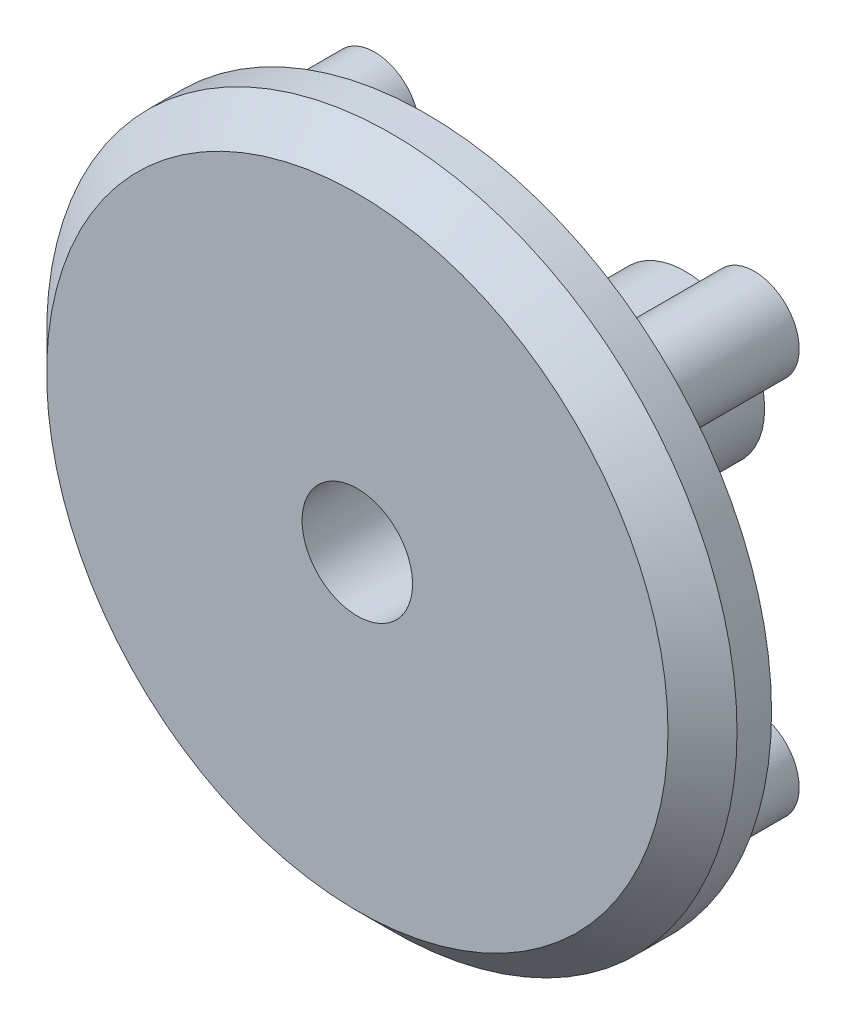
ISO-10303-21;
HEADER;
FILE_DESCRIPTION(('STEP AP214'),'2;1');
FILE_NAME('part.step','',(''),(''),'','','');
FILE_SCHEMA(('AUTOMOTIVE_DESIGN { 1 0 10303 214 1 1 1 1 }'));
ENDSEC;
DATA;
#1=APPLICATION_CONTEXT('core data for automotive mechanical design processes');
#2=APPLICATION_PROTOCOL_DEFINITION('international standard','automotive_design',2000,#1);
#3=PRODUCT_CONTEXT('',#1,'mechanical');
#4=PRODUCT('Part','Part','',(#3));
#5=PRODUCT_RELATED_PRODUCT_CATEGORY('part','',(#4));
#6=PRODUCT_DEFINITION_FORMATION('','',#4);
#7=PRODUCT_DEFINITION_CONTEXT('part definition',#1,'design');
#8=PRODUCT_DEFINITION('design','',#6,#7);
#9=PRODUCT_DEFINITION_SHAPE('','',#8);
#10=(LENGTH_UNIT() NAMED_UNIT(*) SI_UNIT(.MILLI.,.METRE.));
#11=(NAMED_UNIT(*) PLANE_ANGLE_UNIT() SI_UNIT($,.RADIAN.));
#12=(NAMED_UNIT(*) SI_UNIT($,.STERADIAN.) SOLID_ANGLE_UNIT());
#13=UNCERTAINTY_MEASURE_WITH_UNIT(LENGTH_MEASURE(1.E-05),#10,'distance_accuracy_value','');
#14=(GEOMETRIC_REPRESENTATION_CONTEXT(3) GLOBAL_UNCERTAINTY_ASSIGNED_CONTEXT((#13)) GLOBAL_UNIT_ASSIGNED_CONTEXT((#10,
#11,#12)) REPRESENTATION_CONTEXT('',''));
#15=CARTESIAN_POINT('',(0.,0.,0.));
#16=DIRECTION('',(0.,0.,1.));
#17=DIRECTION('',(1.,0.,0.));
#18=AXIS2_PLACEMENT_3D('',#15,#16,#17);
#19=CARTESIAN_POINT('',(0.,0.,2.));
#20=DIRECTION('',(0.,0.,1.));
#21=DIRECTION('',(1.,0.,0.));
#22=AXIS2_PLACEMENT_3D('',#19,#20,#21);
#23=PLANE('',#22);
#24=CARTESIAN_POINT('',(0.,0.,2.));
#25=DIRECTION('',(0.,0.,1.));
#26=DIRECTION('',(1.,0.,0.));
#27=AXIS2_PLACEMENT_3D('',#24,#25,#26);
#28=CIRCLE('',#27,9.00000000000001);
#29=CARTESIAN_POINT('',(9.00000000000001,0.,2.));
#30=VERTEX_POINT('',#29);
#31=EDGE_CURVE('E56',#30,#30,#28,.T.);
#32=ORIENTED_EDGE('',*,*,#31,.T.);
#33=EDGE_LOOP('',(#32));
#34=FACE_BOUND('',#33,.T.);
#35=CARTESIAN_POINT('',(0.,0.,2.));
#36=DIRECTION('',(0.,0.,1.));
#37=DIRECTION('',(1.,0.,0.));
#38=AXIS2_PLACEMENT_3D('',#35,#36,#37);
#39=CIRCLE('',#38,1.6);
#40=CARTESIAN_POINT('',(1.6,0.,2.));
#41=VERTEX_POINT('',#40);
#42=EDGE_CURVE('E64',#41,#41,#39,.T.);
#43=ORIENTED_EDGE('',*,*,#42,.F.);
#44=EDGE_LOOP('',(#43));
#45=FACE_BOUND('',#44,.T.);
#46=ADVANCED_FACE('F48',(#34,#45),#23,.T.);
#47=CARTESIAN_POINT('',(0.,0.,0.));
#48=DIRECTION('',(0.,0.,1.));
#49=DIRECTION('',(1.,0.,0.));
#50=AXIS2_PLACEMENT_3D('',#47,#48,#49);
#51=PLANE('',#50);
#52=CARTESIAN_POINT('',(0.,0.,0.));
#53=DIRECTION('',(0.,0.,1.));
#54=DIRECTION('',(1.,0.,0.));
#55=AXIS2_PLACEMENT_3D('',#52,#53,#54);
#56=CIRCLE('',#55,2.3);
#57=CARTESIAN_POINT('',(2.3,0.,0.));
#58=VERTEX_POINT('',#57);
#59=EDGE_CURVE('E94',#58,#58,#56,.T.);
#60=ORIENTED_EDGE('',*,*,#59,.T.);
#61=EDGE_LOOP('',(#60));
#62=FACE_BOUND('',#61,.T.);
#63=CARTESIAN_POINT('',(-5.5,-5.5,0.));
#64=DIRECTION('',(0.,0.,1.));
#65=DIRECTION('',(1.,0.,0.));
#66=AXIS2_PLACEMENT_3D('',#63,#64,#65);
#67=CIRCLE('',#66,1.3);
#68=CARTESIAN_POINT('',(-4.2,-5.5,0.));
#69=VERTEX_POINT('',#68);
#70=EDGE_CURVE('E88',#69,#69,#67,.T.);
#71=ORIENTED_EDGE('',*,*,#70,.T.);
#72=EDGE_LOOP('',(#71));
#73=FACE_BOUND('',#72,.T.);
#74=CARTESIAN_POINT('',(5.5,-5.5,0.));
#75=DIRECTION('',(0.,0.,1.));
#76=DIRECTION('',(1.,0.,0.));
#77=AXIS2_PLACEMENT_3D('',#74,#75,#76);
#78=CIRCLE('',#77,1.3);
#79=CARTESIAN_POINT('',(6.8,-5.5,0.));
#80=VERTEX_POINT('',#79);
#81=EDGE_CURVE('E82',#80,#80,#78,.T.);
#82=ORIENTED_EDGE('',*,*,#81,.T.);
#83=EDGE_LOOP('',(#82));
#84=FACE_BOUND('',#83,.T.);
#85=CARTESIAN_POINT('',(5.5,5.5,0.));
#86=DIRECTION('',(0.,0.,1.));
#87=DIRECTION('',(1.,0.,0.));
#88=AXIS2_PLACEMENT_3D('',#85,#86,#87);
#89=CIRCLE('',#88,1.3);
#90=CARTESIAN_POINT('',(6.8,5.5,0.));
#91=VERTEX_POINT('',#90);
#92=EDGE_CURVE('E76',#91,#91,#89,.T.);
#93=ORIENTED_EDGE('',*,*,#92,.T.);
#94=EDGE_LOOP('',(#93));
#95=FACE_BOUND('',#94,.T.);
#96=CARTESIAN_POINT('',(-5.5,5.5,0.));
#97=DIRECTION('',(0.,0.,1.));
#98=DIRECTION('',(1.,0.,0.));
#99=AXIS2_PLACEMENT_3D('',#96,#97,#98);
#100=CIRCLE('',#99,1.3);
#101=CARTESIAN_POINT('',(-4.2,5.5,0.));
#102=VERTEX_POINT('',#101);
#103=EDGE_CURVE('E70',#102,#102,#100,.T.);
#104=ORIENTED_EDGE('',*,*,#103,.T.);
#105=EDGE_LOOP('',(#104));
#106=FACE_BOUND('',#105,.T.);
#107=CARTESIAN_POINT('',(0.,0.,0.));
#108=DIRECTION('',(0.,0.,1.));
#109=DIRECTION('',(1.,0.,0.));
#110=AXIS2_PLACEMENT_3D('',#107,#108,#109);
#111=CIRCLE('',#110,10.);
#112=CARTESIAN_POINT('',(9.99999999999999,0.,0.));
#113=VERTEX_POINT('',#112);
#114=EDGE_CURVE('E60',#113,#113,#111,.T.);
#115=ORIENTED_EDGE('',*,*,#114,.F.);
#116=EDGE_LOOP('',(#115));
#117=FACE_BOUND('',#116,.T.);
#118=ADVANCED_FACE('F119',(#62,#73,#84,#95,#106,#117),#51,.F.);
#119=CARTESIAN_POINT('',(0.,0.,2.));
#120=DIRECTION('',(0.,0.,-1.));
#121=DIRECTION('',(-1.,0.,0.));
#122=AXIS2_PLACEMENT_3D('',#119,#120,#121);
#123=CYLINDRICAL_SURFACE('',#122,10.);
#124=CARTESIAN_POINT('',(0.,0.,1.));
#125=DIRECTION('',(0.,0.,1.));
#126=DIRECTION('',(1.,0.,0.));
#127=AXIS2_PLACEMENT_3D('',#124,#125,#126);
#128=CIRCLE('',#127,10.);
#129=CARTESIAN_POINT('',(9.99999999999999,0.,1.));
#130=VERTEX_POINT('',#129);
#131=EDGE_CURVE('E11',#130,#130,#128,.F.);
#132=ORIENTED_EDGE('',*,*,#131,.T.);
#133=EDGE_LOOP('',(#132));
#134=FACE_BOUND('',#133,.T.);
#135=ORIENTED_EDGE('',*,*,#114,.T.);
#136=EDGE_LOOP('',(#135));
#137=FACE_BOUND('',#136,.T.);
#138=ADVANCED_FACE('F109',(#134,#137),#123,.T.);
#139=CARTESIAN_POINT('',(0.,0.,2.));
#140=DIRECTION('',(0.,0.,-1.));
#141=DIRECTION('',(-1.,0.,0.));
#142=AXIS2_PLACEMENT_3D('',#139,#140,#141);
#143=CYLINDRICAL_SURFACE('',#142,1.6);
#144=ORIENTED_EDGE('',*,*,#42,.T.);
#145=EDGE_LOOP('',(#144));
#146=FACE_BOUND('',#145,.T.);
#147=CARTESIAN_POINT('',(0.,0.,-7.5));
#148=DIRECTION('',(0.,0.,1.));
#149=DIRECTION('',(1.,0.,0.));
#150=AXIS2_PLACEMENT_3D('',#147,#148,#149);
#151=CIRCLE('',#150,1.6);
#152=CARTESIAN_POINT('',(1.6,0.,-7.5));
#153=VERTEX_POINT('',#152);
#154=EDGE_CURVE('E97',#153,#153,#151,.T.);
#155=ORIENTED_EDGE('',*,*,#154,.F.);
#156=EDGE_LOOP('',(#155));
#157=FACE_BOUND('',#156,.T.);
#158=ADVANCED_FACE('F106',(#146,#157),#143,.F.);
#159=CARTESIAN_POINT('',(-5.5,5.5,-4.));
#160=DIRECTION('',(0.,0.,1.));
#161=DIRECTION('',(1.,0.,0.));
#162=AXIS2_PLACEMENT_3D('',#159,#160,#161);
#163=CYLINDRICAL_SURFACE('',#162,1.3);
#164=CARTESIAN_POINT('',(-5.5,5.5,-4.));
#165=DIRECTION('',(0.,0.,1.));
#166=DIRECTION('',(1.,0.,0.));
#167=AXIS2_PLACEMENT_3D('',#164,#165,#166);
#168=CIRCLE('',#167,1.3);
#169=CARTESIAN_POINT('',(-4.2,5.5,-4.));
#170=VERTEX_POINT('',#169);
#171=EDGE_CURVE('E69',#170,#170,#168,.T.);
#172=ORIENTED_EDGE('',*,*,#171,.T.);
#173=EDGE_LOOP('',(#172));
#174=FACE_BOUND('',#173,.T.);
#175=ORIENTED_EDGE('',*,*,#103,.F.);
#176=EDGE_LOOP('',(#175));
#177=FACE_BOUND('',#176,.T.);
#178=ADVANCED_FACE('F108',(#174,#177),#163,.T.);
#179=CARTESIAN_POINT('',(0.,0.,-4.));
#180=DIRECTION('',(0.,0.,1.));
#181=DIRECTION('',(1.,0.,0.));
#182=AXIS2_PLACEMENT_3D('',#179,#180,#181);
#183=PLANE('',#182);
#184=ORIENTED_EDGE('',*,*,#171,.F.);
#185=EDGE_LOOP('',(#184));
#186=FACE_BOUND('',#185,.T.);
#187=ADVANCED_FACE('F116',(#186),#183,.F.);
#188=CARTESIAN_POINT('',(5.5,5.5,-4.));
#189=DIRECTION('',(0.,0.,1.));
#190=DIRECTION('',(1.,0.,0.));
#191=AXIS2_PLACEMENT_3D('',#188,#189,#190);
#192=CYLINDRICAL_SURFACE('',#191,1.3);
#193=CARTESIAN_POINT('',(5.5,5.5,-4.));
#194=DIRECTION('',(0.,0.,1.));
#195=DIRECTION('',(1.,0.,0.));
#196=AXIS2_PLACEMENT_3D('',#193,#194,#195);
#197=CIRCLE('',#196,1.3);
#198=CARTESIAN_POINT('',(6.8,5.5,-4.));
#199=VERTEX_POINT('',#198);
#200=EDGE_CURVE('E73',#199,#199,#197,.T.);
#201=ORIENTED_EDGE('',*,*,#200,.T.);
#202=EDGE_LOOP('',(#201));
#203=FACE_BOUND('',#202,.T.);
#204=ORIENTED_EDGE('',*,*,#92,.F.);
#205=EDGE_LOOP('',(#204));
#206=FACE_BOUND('',#205,.T.);
#207=ADVANCED_FACE('F145',(#203,#206),#192,.T.);
#208=CARTESIAN_POINT('',(0.,0.,-4.));
#209=DIRECTION('',(0.,0.,1.));
#210=DIRECTION('',(1.,0.,0.));
#211=AXIS2_PLACEMENT_3D('',#208,#209,#210);
#212=PLANE('',#211);
#213=ORIENTED_EDGE('',*,*,#200,.F.);
#214=EDGE_LOOP('',(#213));
#215=FACE_BOUND('',#214,.T.);
#216=ADVANCED_FACE('F147',(#215),#212,.F.);
#217=CARTESIAN_POINT('',(5.5,-5.5,-4.));
#218=DIRECTION('',(0.,0.,1.));
#219=DIRECTION('',(1.,0.,0.));
#220=AXIS2_PLACEMENT_3D('',#217,#218,#219);
#221=CYLINDRICAL_SURFACE('',#220,1.3);
#222=CARTESIAN_POINT('',(5.5,-5.5,-4.));
#223=DIRECTION('',(0.,0.,1.));
#224=DIRECTION('',(1.,0.,0.));
#225=AXIS2_PLACEMENT_3D('',#222,#223,#224);
#226=CIRCLE('',#225,1.3);
#227=CARTESIAN_POINT('',(6.8,-5.5,-4.));
#228=VERTEX_POINT('',#227);
#229=EDGE_CURVE('E79',#228,#228,#226,.T.);
#230=ORIENTED_EDGE('',*,*,#229,.T.);
#231=EDGE_LOOP('',(#230));
#232=FACE_BOUND('',#231,.T.);
#233=ORIENTED_EDGE('',*,*,#81,.F.);
#234=EDGE_LOOP('',(#233));
#235=FACE_BOUND('',#234,.T.);
#236=ADVANCED_FACE('F154',(#232,#235),#221,.T.);
#237=CARTESIAN_POINT('',(0.,0.,-4.));
#238=DIRECTION('',(0.,0.,1.));
#239=DIRECTION('',(1.,0.,0.));
#240=AXIS2_PLACEMENT_3D('',#237,#238,#239);
#241=PLANE('',#240);
#242=ORIENTED_EDGE('',*,*,#229,.F.);
#243=EDGE_LOOP('',(#242));
#244=FACE_BOUND('',#243,.T.);
#245=ADVANCED_FACE('F162',(#244),#241,.F.);
#246=CARTESIAN_POINT('',(-5.5,-5.5,-4.));
#247=DIRECTION('',(0.,0.,1.));
#248=DIRECTION('',(1.,0.,0.));
#249=AXIS2_PLACEMENT_3D('',#246,#247,#248);
#250=CYLINDRICAL_SURFACE('',#249,1.3);
#251=CARTESIAN_POINT('',(-5.5,-5.5,-4.));
#252=DIRECTION('',(0.,0.,1.));
#253=DIRECTION('',(1.,0.,0.));
#254=AXIS2_PLACEMENT_3D('',#251,#252,#253);
#255=CIRCLE('',#254,1.3);
#256=CARTESIAN_POINT('',(-4.2,-5.5,-4.));
#257=VERTEX_POINT('',#256);
#258=EDGE_CURVE('E85',#257,#257,#255,.T.);
#259=ORIENTED_EDGE('',*,*,#258,.T.);
#260=EDGE_LOOP('',(#259));
#261=FACE_BOUND('',#260,.T.);
#262=ORIENTED_EDGE('',*,*,#70,.F.);
#263=EDGE_LOOP('',(#262));
#264=FACE_BOUND('',#263,.T.);
#265=ADVANCED_FACE('F166',(#261,#264),#250,.T.);
#266=CARTESIAN_POINT('',(0.,0.,-4.));
#267=DIRECTION('',(0.,0.,1.));
#268=DIRECTION('',(1.,0.,0.));
#269=AXIS2_PLACEMENT_3D('',#266,#267,#268);
#270=PLANE('',#269);
#271=ORIENTED_EDGE('',*,*,#258,.F.);
#272=EDGE_LOOP('',(#271));
#273=FACE_BOUND('',#272,.T.);
#274=ADVANCED_FACE('F170',(#273),#270,.F.);
#275=CARTESIAN_POINT('',(0.,0.,2.));
#276=DIRECTION('',(0.,0.,-1.));
#277=DIRECTION('',(-1.,0.,0.));
#278=AXIS2_PLACEMENT_3D('',#275,#276,#277);
#279=CONICAL_SURFACE('',#278,9.00000000000001,0.785398163397447);
#280=ORIENTED_EDGE('',*,*,#131,.F.);
#281=EDGE_LOOP('',(#280));
#282=FACE_BOUND('',#281,.T.);
#283=ORIENTED_EDGE('',*,*,#31,.F.);
#284=EDGE_LOOP('',(#283));
#285=FACE_BOUND('',#284,.T.);
#286=ADVANCED_FACE('F51',(#282,#285),#279,.T.);
#287=CARTESIAN_POINT('',(0.,0.,-7.5));
#288=DIRECTION('',(0.,0.,1.));
#289=DIRECTION('',(1.,0.,0.));
#290=AXIS2_PLACEMENT_3D('',#287,#288,#289);
#291=CYLINDRICAL_SURFACE('',#290,2.3);
#292=CARTESIAN_POINT('',(0.,0.,-7.5));
#293=DIRECTION('',(0.,0.,1.));
#294=DIRECTION('',(1.,0.,0.));
#295=AXIS2_PLACEMENT_3D('',#292,#293,#294);
#296=CIRCLE('',#295,2.3);
#297=CARTESIAN_POINT('',(2.3,0.,-7.5));
#298=VERTEX_POINT('',#297);
#299=EDGE_CURVE('E91',#298,#298,#296,.T.);
#300=ORIENTED_EDGE('',*,*,#299,.T.);
#301=EDGE_LOOP('',(#300));
#302=FACE_BOUND('',#301,.T.);
#303=ORIENTED_EDGE('',*,*,#59,.F.);
#304=EDGE_LOOP('',(#303));
#305=FACE_BOUND('',#304,.T.);
#306=ADVANCED_FACE('F175',(#302,#305),#291,.T.);
#307=CARTESIAN_POINT('',(0.,0.,-7.5));
#308=DIRECTION('',(0.,0.,1.));
#309=DIRECTION('',(1.,0.,0.));
#310=AXIS2_PLACEMENT_3D('',#307,#308,#309);
#311=PLANE('',#310);
#312=ORIENTED_EDGE('',*,*,#154,.T.);
#313=EDGE_LOOP('',(#312));
#314=FACE_BOUND('',#313,.T.);
#315=ORIENTED_EDGE('',*,*,#299,.F.);
#316=EDGE_LOOP('',(#315));
#317=FACE_BOUND('',#316,.T.);
#318=ADVANCED_FACE('F103',(#314,#317),#311,.F.);
#319=CLOSED_SHELL('',(#46,#118,#138,#158,#178,#187,#207,#216,#236,#245,#265,#274,#286,#306,#318));
#320=MANIFOLD_SOLID_BREP('B2',#319);
#321=ADVANCED_BREP_SHAPE_REPRESENTATION('',(#18,#320),#14);
#322=SHAPE_DEFINITION_REPRESENTATION(#9,#321);
ENDSEC;
END-ISO-10303-21;
